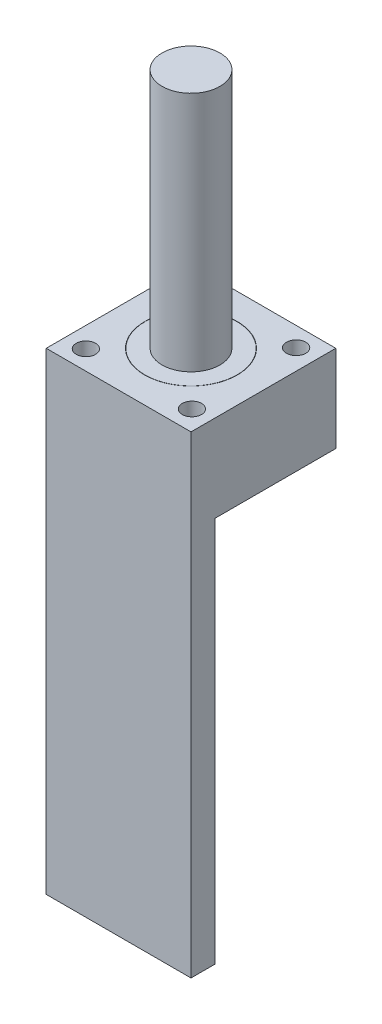
ISO-10303-21;
HEADER;
FILE_DESCRIPTION(('STEP AP214'),'2;1');
FILE_NAME('part.step','',(''),(''),'','','');
FILE_SCHEMA(('AUTOMOTIVE_DESIGN { 1 0 10303 214 1 1 1 1 }'));
ENDSEC;
DATA;
#1=APPLICATION_CONTEXT('core data for automotive mechanical design processes');
#2=APPLICATION_PROTOCOL_DEFINITION('international standard','automotive_design',2000,#1);
#3=PRODUCT_CONTEXT('',#1,'mechanical');
#4=PRODUCT('Part','Part','',(#3));
#5=PRODUCT_RELATED_PRODUCT_CATEGORY('part','',(#4));
#6=PRODUCT_DEFINITION_FORMATION('','',#4);
#7=PRODUCT_DEFINITION_CONTEXT('part definition',#1,'design');
#8=PRODUCT_DEFINITION('design','',#6,#7);
#9=PRODUCT_DEFINITION_SHAPE('','',#8);
#10=(LENGTH_UNIT() NAMED_UNIT(*) SI_UNIT(.MILLI.,.METRE.));
#11=(NAMED_UNIT(*) PLANE_ANGLE_UNIT() SI_UNIT($,.RADIAN.));
#12=(NAMED_UNIT(*) SI_UNIT($,.STERADIAN.) SOLID_ANGLE_UNIT());
#13=UNCERTAINTY_MEASURE_WITH_UNIT(LENGTH_MEASURE(1.E-05),#10,'distance_accuracy_value','');
#14=(GEOMETRIC_REPRESENTATION_CONTEXT(3) GLOBAL_UNCERTAINTY_ASSIGNED_CONTEXT((#13)) GLOBAL_UNIT_ASSIGNED_CONTEXT((#10,
#11,#12)) REPRESENTATION_CONTEXT('',''));
#15=CARTESIAN_POINT('',(0.,0.,0.));
#16=DIRECTION('',(0.,0.,1.));
#17=DIRECTION('',(1.,0.,0.));
#18=AXIS2_PLACEMENT_3D('',#15,#16,#17);
#19=CARTESIAN_POINT('',(0.,-18.,0.));
#20=DIRECTION('',(0.,1.,0.));
#21=DIRECTION('',(0.,0.,1.));
#22=AXIS2_PLACEMENT_3D('',#19,#20,#21);
#23=PLANE('',#22);
#24=DIRECTION('',(1.,0.,0.));
#25=VECTOR('',#24,1.);
#26=CARTESIAN_POINT('',(15.,-18.,10.));
#27=LINE('',#26,#25);
#28=CARTESIAN_POINT('',(-15.,-18.,10.));
#29=VERTEX_POINT('',#28);
#30=CARTESIAN_POINT('',(15.,-18.,10.));
#31=VERTEX_POINT('',#30);
#32=EDGE_CURVE('E65',#29,#31,#27,.T.);
#33=ORIENTED_EDGE('',*,*,#32,.F.);
#34=DIRECTION('',(0.,0.,-1.));
#35=VECTOR('',#34,1.);
#36=CARTESIAN_POINT('',(-15.,-18.,15.));
#37=LINE('',#36,#35);
#38=CARTESIAN_POINT('',(-15.,-18.,-15.));
#39=VERTEX_POINT('',#38);
#40=EDGE_CURVE('E146',#29,#39,#37,.T.);
#41=ORIENTED_EDGE('',*,*,#40,.T.);
#42=DIRECTION('',(1.,0.,0.));
#43=VECTOR('',#42,1.);
#44=CARTESIAN_POINT('',(15.,-18.,-15.));
#45=LINE('',#44,#43);
#46=CARTESIAN_POINT('',(15.,-18.,-15.));
#47=VERTEX_POINT('',#46);
#48=EDGE_CURVE('E149',#39,#47,#45,.T.);
#49=ORIENTED_EDGE('',*,*,#48,.T.);
#50=DIRECTION('',(0.,0.,1.));
#51=VECTOR('',#50,1.);
#52=CARTESIAN_POINT('',(15.,-18.,15.));
#53=LINE('',#52,#51);
#54=EDGE_CURVE('E143',#47,#31,#53,.T.);
#55=ORIENTED_EDGE('',*,*,#54,.T.);
#56=EDGE_LOOP('',(#33,#41,#49,#55));
#57=FACE_BOUND('',#56,.T.);
#58=ADVANCED_FACE('F49',(#57),#23,.F.);
#59=CARTESIAN_POINT('',(15.,0.,-15.));
#60=DIRECTION('',(-1.,0.,0.));
#61=DIRECTION('',(0.,0.,1.));
#62=AXIS2_PLACEMENT_3D('',#59,#60,#61);
#63=PLANE('',#62);
#64=DIRECTION('',(0.,-1.,0.));
#65=VECTOR('',#64,1.);
#66=CARTESIAN_POINT('',(15.,0.,15.));
#67=LINE('',#66,#65);
#68=CARTESIAN_POINT('',(15.,0.,15.));
#69=VERTEX_POINT('',#68);
#70=CARTESIAN_POINT('',(15.,-98.,15.));
#71=VERTEX_POINT('',#70);
#72=EDGE_CURVE('E103',#69,#71,#67,.T.);
#73=ORIENTED_EDGE('',*,*,#72,.T.);
#74=DIRECTION('',(0.,0.,1.));
#75=VECTOR('',#74,1.);
#76=CARTESIAN_POINT('',(15.,-98.,15.));
#77=LINE('',#76,#75);
#78=CARTESIAN_POINT('',(15.,-98.,10.));
#79=VERTEX_POINT('',#78);
#80=EDGE_CURVE('E107',#79,#71,#77,.T.);
#81=ORIENTED_EDGE('',*,*,#80,.F.);
#82=DIRECTION('',(0.,1.,0.));
#83=VECTOR('',#82,1.);
#84=CARTESIAN_POINT('',(15.,-98.,10.));
#85=LINE('',#84,#83);
#86=EDGE_CURVE('E135',#79,#31,#85,.T.);
#87=ORIENTED_EDGE('',*,*,#86,.T.);
#88=ORIENTED_EDGE('',*,*,#54,.F.);
#89=DIRECTION('',(0.,-1.,0.));
#90=VECTOR('',#89,1.);
#91=CARTESIAN_POINT('',(15.,0.,-15.));
#92=LINE('',#91,#90);
#93=CARTESIAN_POINT('',(15.,0.,-15.));
#94=VERTEX_POINT('',#93);
#95=EDGE_CURVE('E12',#94,#47,#92,.T.);
#96=ORIENTED_EDGE('',*,*,#95,.F.);
#97=DIRECTION('',(0.,0.,-1.));
#98=VECTOR('',#97,1.);
#99=CARTESIAN_POINT('',(15.,0.,-15.));
#100=LINE('',#99,#98);
#101=EDGE_CURVE('E109',#69,#94,#100,.T.);
#102=ORIENTED_EDGE('',*,*,#101,.F.);
#103=EDGE_LOOP('',(#73,#81,#87,#88,#96,#102));
#104=FACE_BOUND('',#103,.T.);
#105=ADVANCED_FACE('F51',(#104),#63,.F.);
#106=CARTESIAN_POINT('',(-15.,0.,-15.));
#107=DIRECTION('',(0.,0.,1.));
#108=DIRECTION('',(1.,0.,0.));
#109=AXIS2_PLACEMENT_3D('',#106,#107,#108);
#110=PLANE('',#109);
#111=ORIENTED_EDGE('',*,*,#95,.T.);
#112=ORIENTED_EDGE('',*,*,#48,.F.);
#113=DIRECTION('',(0.,-1.,0.));
#114=VECTOR('',#113,1.);
#115=CARTESIAN_POINT('',(-15.,0.,-15.));
#116=LINE('',#115,#114);
#117=CARTESIAN_POINT('',(-15.,0.,-15.));
#118=VERTEX_POINT('',#117);
#119=EDGE_CURVE('E58',#118,#39,#116,.T.);
#120=ORIENTED_EDGE('',*,*,#119,.F.);
#121=DIRECTION('',(-1.,0.,0.));
#122=VECTOR('',#121,1.);
#123=CARTESIAN_POINT('',(-15.,0.,-15.));
#124=LINE('',#123,#122);
#125=EDGE_CURVE('E211',#94,#118,#124,.T.);
#126=ORIENTED_EDGE('',*,*,#125,.F.);
#127=EDGE_LOOP('',(#111,#112,#120,#126));
#128=FACE_BOUND('',#127,.T.);
#129=ADVANCED_FACE('F229',(#128),#110,.F.);
#130=CARTESIAN_POINT('',(-15.,0.,-15.));
#131=DIRECTION('',(1.,0.,0.));
#132=DIRECTION('',(0.,0.,-1.));
#133=AXIS2_PLACEMENT_3D('',#130,#131,#132);
#134=PLANE('',#133);
#135=ORIENTED_EDGE('',*,*,#119,.T.);
#136=ORIENTED_EDGE('',*,*,#40,.F.);
#137=DIRECTION('',(0.,1.,0.));
#138=VECTOR('',#137,1.);
#139=CARTESIAN_POINT('',(-15.,-98.,9.99999999999999));
#140=LINE('',#139,#138);
#141=CARTESIAN_POINT('',(-15.,-98.,9.99999999999999));
#142=VERTEX_POINT('',#141);
#143=EDGE_CURVE('E139',#142,#29,#140,.T.);
#144=ORIENTED_EDGE('',*,*,#143,.F.);
#145=DIRECTION('',(0.,0.,-1.));
#146=VECTOR('',#145,1.);
#147=CARTESIAN_POINT('',(-15.,-98.,15.));
#148=LINE('',#147,#146);
#149=CARTESIAN_POINT('',(-15.,-98.,15.));
#150=VERTEX_POINT('',#149);
#151=EDGE_CURVE('E121',#150,#142,#148,.T.);
#152=ORIENTED_EDGE('',*,*,#151,.F.);
#153=DIRECTION('',(0.,-1.,0.));
#154=VECTOR('',#153,1.);
#155=CARTESIAN_POINT('',(-15.,0.,15.));
#156=LINE('',#155,#154);
#157=CARTESIAN_POINT('',(-15.,0.,15.));
#158=VERTEX_POINT('',#157);
#159=EDGE_CURVE('E112',#158,#150,#156,.T.);
#160=ORIENTED_EDGE('',*,*,#159,.F.);
#161=DIRECTION('',(0.,0.,1.));
#162=VECTOR('',#161,1.);
#163=CARTESIAN_POINT('',(-15.,0.,-15.));
#164=LINE('',#163,#162);
#165=EDGE_CURVE('E214',#118,#158,#164,.T.);
#166=ORIENTED_EDGE('',*,*,#165,.F.);
#167=EDGE_LOOP('',(#135,#136,#144,#152,#160,#166));
#168=FACE_BOUND('',#167,.T.);
#169=ADVANCED_FACE('F226',(#168),#134,.F.);
#170=CARTESIAN_POINT('',(-15.,0.,15.));
#171=DIRECTION('',(0.,0.,-1.));
#172=DIRECTION('',(-1.,0.,0.));
#173=AXIS2_PLACEMENT_3D('',#170,#171,#172);
#174=PLANE('',#173);
#175=ORIENTED_EDGE('',*,*,#159,.T.);
#176=DIRECTION('',(-1.,0.,0.));
#177=VECTOR('',#176,1.);
#178=CARTESIAN_POINT('',(15.,-98.,15.));
#179=LINE('',#178,#177);
#180=EDGE_CURVE('E115',#71,#150,#179,.T.);
#181=ORIENTED_EDGE('',*,*,#180,.F.);
#182=ORIENTED_EDGE('',*,*,#72,.F.);
#183=DIRECTION('',(1.,0.,0.));
#184=VECTOR('',#183,1.);
#185=CARTESIAN_POINT('',(-15.,0.,15.));
#186=LINE('',#185,#184);
#187=EDGE_CURVE('E73',#158,#69,#186,.T.);
#188=ORIENTED_EDGE('',*,*,#187,.F.);
#189=EDGE_LOOP('',(#175,#181,#182,#188));
#190=FACE_BOUND('',#189,.T.);
#191=ADVANCED_FACE('F116',(#190),#174,.F.);
#192=CARTESIAN_POINT('',(0.,0.,0.));
#193=DIRECTION('',(0.,1.,0.));
#194=DIRECTION('',(0.,0.,1.));
#195=AXIS2_PLACEMENT_3D('',#192,#193,#194);
#196=PLANE('',#195);
#197=CARTESIAN_POINT('',(-10.9875097580016,0.,-10.7923497267759));
#198=DIRECTION('',(0.,1.,0.));
#199=DIRECTION('',(1.,0.,0.));
#200=AXIS2_PLACEMENT_3D('',#197,#198,#199);
#201=CIRCLE('',#200,2.);
#202=CARTESIAN_POINT('',(-8.98750975800163,0.,-10.7923497267759));
#203=VERTEX_POINT('',#202);
#204=EDGE_CURVE('E158',#203,#203,#201,.T.);
#205=ORIENTED_EDGE('',*,*,#204,.F.);
#206=EDGE_LOOP('',(#205));
#207=FACE_BOUND('',#206,.T.);
#208=CARTESIAN_POINT('',(-10.792349726776,0.,10.9875097580016));
#209=DIRECTION('',(0.,1.,0.));
#210=DIRECTION('',(0.,0.,-1.));
#211=AXIS2_PLACEMENT_3D('',#208,#209,#210);
#212=CIRCLE('',#211,2.);
#213=CARTESIAN_POINT('',(-10.792349726776,0.,8.9875097580016));
#214=VERTEX_POINT('',#213);
#215=EDGE_CURVE('E159',#214,#214,#212,.T.);
#216=ORIENTED_EDGE('',*,*,#215,.F.);
#217=EDGE_LOOP('',(#216));
#218=FACE_BOUND('',#217,.T.);
#219=CARTESIAN_POINT('',(10.9875097580017,0.,10.7923497267758));
#220=DIRECTION('',(0.,1.,0.));
#221=DIRECTION('',(-1.,0.,0.));
#222=AXIS2_PLACEMENT_3D('',#219,#220,#221);
#223=CIRCLE('',#222,2.);
#224=CARTESIAN_POINT('',(8.98750975800172,0.,10.7923497267759));
#225=VERTEX_POINT('',#224);
#226=EDGE_CURVE('E168',#225,#225,#223,.T.);
#227=ORIENTED_EDGE('',*,*,#226,.F.);
#228=EDGE_LOOP('',(#227));
#229=FACE_BOUND('',#228,.T.);
#230=CARTESIAN_POINT('',(10.792349726776,0.,-10.9875097580016));
#231=DIRECTION('',(0.,1.,0.));
#232=DIRECTION('',(0.,0.,1.));
#233=AXIS2_PLACEMENT_3D('',#230,#231,#232);
#234=CIRCLE('',#233,2.);
#235=CARTESIAN_POINT('',(10.792349726776,0.,-8.9875097580016));
#236=VERTEX_POINT('',#235);
#237=EDGE_CURVE('E163',#236,#236,#234,.T.);
#238=ORIENTED_EDGE('',*,*,#237,.F.);
#239=EDGE_LOOP('',(#238));
#240=FACE_BOUND('',#239,.T.);
#241=CARTESIAN_POINT('',(0.,0.,0.));
#242=DIRECTION('',(0.,1.,0.));
#243=DIRECTION('',(0.,0.,1.));
#244=AXIS2_PLACEMENT_3D('',#241,#242,#243);
#245=CIRCLE('',#244,9.6);
#246=CARTESIAN_POINT('',(0.,0.,9.6));
#247=VERTEX_POINT('',#246);
#248=EDGE_CURVE('E198',#247,#247,#245,.T.);
#249=ORIENTED_EDGE('',*,*,#248,.F.);
#250=EDGE_LOOP('',(#249));
#251=FACE_BOUND('',#250,.T.);
#252=ORIENTED_EDGE('',*,*,#101,.T.);
#253=ORIENTED_EDGE('',*,*,#125,.T.);
#254=ORIENTED_EDGE('',*,*,#165,.T.);
#255=ORIENTED_EDGE('',*,*,#187,.T.);
#256=EDGE_LOOP('',(#252,#253,#254,#255));
#257=FACE_BOUND('',#256,.T.);
#258=ADVANCED_FACE('F287',(#207,#218,#229,#240,#251,#257),#196,.T.);
#259=CARTESIAN_POINT('',(0.,-7.,0.));
#260=DIRECTION('',(0.,1.,0.));
#261=DIRECTION('',(0.,0.,1.));
#262=AXIS2_PLACEMENT_3D('',#259,#260,#261);
#263=CYLINDRICAL_SURFACE('',#262,9.6);
#264=CARTESIAN_POINT('',(0.,-7.,0.));
#265=DIRECTION('',(0.,1.,0.));
#266=DIRECTION('',(0.,0.,1.));
#267=AXIS2_PLACEMENT_3D('',#264,#265,#266);
#268=CIRCLE('',#267,9.6);
#269=CARTESIAN_POINT('',(0.,-7.,9.6));
#270=VERTEX_POINT('',#269);
#271=EDGE_CURVE('E202',#270,#270,#268,.T.);
#272=ORIENTED_EDGE('',*,*,#271,.F.);
#273=EDGE_LOOP('',(#272));
#274=FACE_BOUND('',#273,.T.);
#275=ORIENTED_EDGE('',*,*,#248,.T.);
#276=EDGE_LOOP('',(#275));
#277=FACE_BOUND('',#276,.T.);
#278=ADVANCED_FACE('F283',(#274,#277),#263,.F.);
#279=CARTESIAN_POINT('',(0.,-7.,0.));
#280=DIRECTION('',(0.,1.,0.));
#281=DIRECTION('',(0.,0.,1.));
#282=AXIS2_PLACEMENT_3D('',#279,#280,#281);
#283=PLANE('',#282);
#284=CARTESIAN_POINT('',(0.,-7.,0.));
#285=DIRECTION('',(0.,1.,0.));
#286=DIRECTION('',(0.,0.,1.));
#287=AXIS2_PLACEMENT_3D('',#284,#285,#286);
#288=CIRCLE('',#287,9.55);
#289=CARTESIAN_POINT('',(0.,-7.,9.55));
#290=VERTEX_POINT('',#289);
#291=EDGE_CURVE('E194',#290,#290,#288,.T.);
#292=ORIENTED_EDGE('',*,*,#291,.F.);
#293=EDGE_LOOP('',(#292));
#294=FACE_BOUND('',#293,.T.);
#295=ORIENTED_EDGE('',*,*,#271,.T.);
#296=EDGE_LOOP('',(#295));
#297=FACE_BOUND('',#296,.T.);
#298=ADVANCED_FACE('F279',(#294,#297),#283,.T.);
#299=CARTESIAN_POINT('',(0.,-7.,0.));
#300=DIRECTION('',(0.,1.,0.));
#301=DIRECTION('',(0.,0.,1.));
#302=AXIS2_PLACEMENT_3D('',#299,#300,#301);
#303=CYLINDRICAL_SURFACE('',#302,9.55);
#304=ORIENTED_EDGE('',*,*,#291,.T.);
#305=EDGE_LOOP('',(#304));
#306=FACE_BOUND('',#305,.T.);
#307=CARTESIAN_POINT('',(0.,0.,0.));
#308=DIRECTION('',(0.,1.,0.));
#309=DIRECTION('',(0.,0.,1.));
#310=AXIS2_PLACEMENT_3D('',#307,#308,#309);
#311=CIRCLE('',#310,9.55);
#312=CARTESIAN_POINT('',(0.,0.,9.55));
#313=VERTEX_POINT('',#312);
#314=EDGE_CURVE('E190',#313,#313,#311,.T.);
#315=ORIENTED_EDGE('',*,*,#314,.F.);
#316=EDGE_LOOP('',(#315));
#317=FACE_BOUND('',#316,.T.);
#318=ADVANCED_FACE('F276',(#306,#317),#303,.T.);
#319=CARTESIAN_POINT('',(0.,0.,0.));
#320=DIRECTION('',(0.,1.,0.));
#321=DIRECTION('',(0.,0.,1.));
#322=AXIS2_PLACEMENT_3D('',#319,#320,#321);
#323=CIRCLE('',#322,4.);
#324=CARTESIAN_POINT('',(0.,0.,4.));
#325=VERTEX_POINT('',#324);
#326=EDGE_CURVE('E182',#325,#325,#323,.T.);
#327=ORIENTED_EDGE('',*,*,#326,.F.);
#328=EDGE_LOOP('',(#327));
#329=FACE_BOUND('',#328,.T.);
#330=ORIENTED_EDGE('',*,*,#314,.T.);
#331=EDGE_LOOP('',(#330));
#332=FACE_BOUND('',#331,.T.);
#333=ADVANCED_FACE('F274',(#329,#332),#196,.T.);
#334=CARTESIAN_POINT('',(0.,-7.,0.));
#335=DIRECTION('',(0.,1.,0.));
#336=DIRECTION('',(0.,0.,1.));
#337=AXIS2_PLACEMENT_3D('',#334,#335,#336);
#338=CYLINDRICAL_SURFACE('',#337,4.);
#339=CARTESIAN_POINT('',(0.,-7.,0.));
#340=DIRECTION('',(0.,1.,0.));
#341=DIRECTION('',(0.,0.,1.));
#342=AXIS2_PLACEMENT_3D('',#339,#340,#341);
#343=CIRCLE('',#342,4.);
#344=CARTESIAN_POINT('',(0.,-7.,4.));
#345=VERTEX_POINT('',#344);
#346=EDGE_CURVE('E186',#345,#345,#343,.T.);
#347=ORIENTED_EDGE('',*,*,#346,.F.);
#348=EDGE_LOOP('',(#347));
#349=FACE_BOUND('',#348,.T.);
#350=ORIENTED_EDGE('',*,*,#326,.T.);
#351=EDGE_LOOP('',(#350));
#352=FACE_BOUND('',#351,.T.);
#353=ADVANCED_FACE('F270',(#349,#352),#338,.F.);
#354=CARTESIAN_POINT('',(0.,-7.,0.));
#355=DIRECTION('',(0.,1.,0.));
#356=DIRECTION('',(0.,0.,1.));
#357=AXIS2_PLACEMENT_3D('',#354,#355,#356);
#358=PLANE('',#357);
#359=ORIENTED_EDGE('',*,*,#346,.T.);
#360=EDGE_LOOP('',(#359));
#361=FACE_BOUND('',#360,.T.);
#362=ADVANCED_FACE('F266',(#361),#358,.T.);
#363=CARTESIAN_POINT('',(10.792349726776,-10.,-10.9875097580016));
#364=DIRECTION('',(0.,1.,0.));
#365=DIRECTION('',(0.,0.,1.));
#366=AXIS2_PLACEMENT_3D('',#363,#364,#365);
#367=CYLINDRICAL_SURFACE('',#366,2.);
#368=CARTESIAN_POINT('',(10.792349726776,-10.,-10.9875097580016));
#369=DIRECTION('',(0.,1.,0.));
#370=DIRECTION('',(0.,0.,1.));
#371=AXIS2_PLACEMENT_3D('',#368,#369,#370);
#372=CIRCLE('',#371,2.);
#373=CARTESIAN_POINT('',(10.792349726776,-10.,-8.9875097580016));
#374=VERTEX_POINT('',#373);
#375=EDGE_CURVE('E178',#374,#374,#372,.T.);
#376=ORIENTED_EDGE('',*,*,#375,.F.);
#377=EDGE_LOOP('',(#376));
#378=FACE_BOUND('',#377,.T.);
#379=ORIENTED_EDGE('',*,*,#237,.T.);
#380=EDGE_LOOP('',(#379));
#381=FACE_BOUND('',#380,.T.);
#382=ADVANCED_FACE('F262',(#378,#381),#367,.F.);
#383=CARTESIAN_POINT('',(10.9875097580017,-10.,10.7923497267758));
#384=DIRECTION('',(0.,1.,0.));
#385=DIRECTION('',(-1.,0.,0.));
#386=AXIS2_PLACEMENT_3D('',#383,#384,#385);
#387=CYLINDRICAL_SURFACE('',#386,2.);
#388=CARTESIAN_POINT('',(10.9875097580017,-10.,10.7923497267758));
#389=DIRECTION('',(0.,1.,0.));
#390=DIRECTION('',(-1.,0.,0.));
#391=AXIS2_PLACEMENT_3D('',#388,#389,#390);
#392=CIRCLE('',#391,2.);
#393=CARTESIAN_POINT('',(8.98750975800172,-10.,10.7923497267759));
#394=VERTEX_POINT('',#393);
#395=EDGE_CURVE('E153',#394,#394,#392,.T.);
#396=ORIENTED_EDGE('',*,*,#395,.F.);
#397=EDGE_LOOP('',(#396));
#398=FACE_BOUND('',#397,.T.);
#399=ORIENTED_EDGE('',*,*,#226,.T.);
#400=EDGE_LOOP('',(#399));
#401=FACE_BOUND('',#400,.T.);
#402=ADVANCED_FACE('F258',(#398,#401),#387,.F.);
#403=CARTESIAN_POINT('',(-10.792349726776,-10.,10.9875097580016));
#404=DIRECTION('',(0.,1.,0.));
#405=DIRECTION('',(0.,0.,-1.));
#406=AXIS2_PLACEMENT_3D('',#403,#404,#405);
#407=CYLINDRICAL_SURFACE('',#406,2.);
#408=CARTESIAN_POINT('',(-10.792349726776,-10.,10.9875097580016));
#409=DIRECTION('',(0.,1.,0.));
#410=DIRECTION('',(0.,0.,-1.));
#411=AXIS2_PLACEMENT_3D('',#408,#409,#410);
#412=CIRCLE('',#411,2.);
#413=CARTESIAN_POINT('',(-10.792349726776,-10.,8.9875097580016));
#414=VERTEX_POINT('',#413);
#415=EDGE_CURVE('E164',#414,#414,#412,.T.);
#416=ORIENTED_EDGE('',*,*,#415,.F.);
#417=EDGE_LOOP('',(#416));
#418=FACE_BOUND('',#417,.T.);
#419=ORIENTED_EDGE('',*,*,#215,.T.);
#420=EDGE_LOOP('',(#419));
#421=FACE_BOUND('',#420,.T.);
#422=ADVANCED_FACE('F254',(#418,#421),#407,.F.);
#423=CARTESIAN_POINT('',(-10.9875097580016,-10.,-10.7923497267759));
#424=DIRECTION('',(0.,1.,0.));
#425=DIRECTION('',(1.,0.,0.));
#426=AXIS2_PLACEMENT_3D('',#423,#424,#425);
#427=CYLINDRICAL_SURFACE('',#426,2.);
#428=CARTESIAN_POINT('',(-10.9875097580016,-10.,-10.7923497267759));
#429=DIRECTION('',(0.,1.,0.));
#430=DIRECTION('',(1.,0.,0.));
#431=AXIS2_PLACEMENT_3D('',#428,#429,#430);
#432=CIRCLE('',#431,2.);
#433=CARTESIAN_POINT('',(-8.98750975800163,-10.,-10.7923497267759));
#434=VERTEX_POINT('',#433);
#435=EDGE_CURVE('E154',#434,#434,#432,.T.);
#436=ORIENTED_EDGE('',*,*,#435,.F.);
#437=EDGE_LOOP('',(#436));
#438=FACE_BOUND('',#437,.T.);
#439=ORIENTED_EDGE('',*,*,#204,.T.);
#440=EDGE_LOOP('',(#439));
#441=FACE_BOUND('',#440,.T.);
#442=ADVANCED_FACE('F251',(#438,#441),#427,.F.);
#443=CARTESIAN_POINT('',(0.,-10.,0.));
#444=DIRECTION('',(0.,1.,0.));
#445=DIRECTION('',(0.,0.,1.));
#446=AXIS2_PLACEMENT_3D('',#443,#444,#445);
#447=PLANE('',#446);
#448=ORIENTED_EDGE('',*,*,#375,.T.);
#449=EDGE_LOOP('',(#448));
#450=FACE_BOUND('',#449,.T.);
#451=ADVANCED_FACE('F244',(#450),#447,.T.);
#452=ORIENTED_EDGE('',*,*,#395,.T.);
#453=EDGE_LOOP('',(#452));
#454=FACE_BOUND('',#453,.T.);
#455=ADVANCED_FACE('F360',(#454),#447,.T.);
#456=ORIENTED_EDGE('',*,*,#415,.T.);
#457=EDGE_LOOP('',(#456));
#458=FACE_BOUND('',#457,.T.);
#459=ADVANCED_FACE('F241',(#458),#447,.T.);
#460=ORIENTED_EDGE('',*,*,#435,.T.);
#461=EDGE_LOOP('',(#460));
#462=FACE_BOUND('',#461,.T.);
#463=ADVANCED_FACE('F234',(#462),#447,.T.);
#464=CARTESIAN_POINT('',(15.,-98.,10.));
#465=DIRECTION('',(0.,0.,1.));
#466=DIRECTION('',(1.,0.,0.));
#467=AXIS2_PLACEMENT_3D('',#464,#465,#466);
#468=PLANE('',#467);
#469=ORIENTED_EDGE('',*,*,#32,.T.);
#470=ORIENTED_EDGE('',*,*,#86,.F.);
#471=DIRECTION('',(1.,0.,0.));
#472=VECTOR('',#471,1.);
#473=CARTESIAN_POINT('',(15.,-98.,10.));
#474=LINE('',#473,#472);
#475=EDGE_CURVE('E125',#142,#79,#474,.T.);
#476=ORIENTED_EDGE('',*,*,#475,.F.);
#477=ORIENTED_EDGE('',*,*,#143,.T.);
#478=EDGE_LOOP('',(#469,#470,#476,#477));
#479=FACE_BOUND('',#478,.T.);
#480=ADVANCED_FACE('F232',(#479),#468,.F.);
#481=CARTESIAN_POINT('',(0.,-98.,0.));
#482=DIRECTION('',(0.,1.,0.));
#483=DIRECTION('',(0.,0.,1.));
#484=AXIS2_PLACEMENT_3D('',#481,#482,#483);
#485=PLANE('',#484);
#486=ORIENTED_EDGE('',*,*,#80,.T.);
#487=ORIENTED_EDGE('',*,*,#180,.T.);
#488=ORIENTED_EDGE('',*,*,#151,.T.);
#489=ORIENTED_EDGE('',*,*,#475,.T.);
#490=EDGE_LOOP('',(#486,#487,#488,#489));
#491=FACE_BOUND('',#490,.T.);
#492=ADVANCED_FACE('F123',(#491),#485,.F.);
#493=CLOSED_SHELL('',(#58,#105,#129,#169,#191,#258,#278,#298,#318,#333,#353,#362,#382,#402,#422,
#442,#451,#455,#459,#463,#480,#492));
#494=MANIFOLD_SOLID_BREP('B2',#493);
#495=CARTESIAN_POINT('',(0.,50.,0.));
#496=DIRECTION('',(0.,-1.,0.));
#497=DIRECTION('',(0.,0.,-1.));
#498=AXIS2_PLACEMENT_3D('',#495,#496,#497);
#499=CYLINDRICAL_SURFACE('',#498,6.);
#500=CARTESIAN_POINT('',(0.,50.,0.));
#501=DIRECTION('',(0.,1.,0.));
#502=DIRECTION('',(0.,0.,1.));
#503=AXIS2_PLACEMENT_3D('',#500,#501,#502);
#504=CIRCLE('',#503,6.);
#505=CARTESIAN_POINT('',(0.,50.,6.));
#506=VERTEX_POINT('',#505);
#507=EDGE_CURVE('E48',#506,#506,#504,.T.);
#508=ORIENTED_EDGE('',*,*,#507,.F.);
#509=EDGE_LOOP('',(#508));
#510=FACE_BOUND('',#509,.T.);
#511=CARTESIAN_POINT('',(0.,0.,0.));
#512=DIRECTION('',(0.,1.,0.));
#513=DIRECTION('',(0.,0.,1.));
#514=AXIS2_PLACEMENT_3D('',#511,#512,#513);
#515=CIRCLE('',#514,6.);
#516=CARTESIAN_POINT('',(0.,0.,6.));
#517=VERTEX_POINT('',#516);
#518=EDGE_CURVE('E497',#517,#517,#515,.T.);
#519=ORIENTED_EDGE('',*,*,#518,.T.);
#520=EDGE_LOOP('',(#519));
#521=FACE_BOUND('',#520,.T.);
#522=ADVANCED_FACE('F494',(#510,#521),#499,.T.);
#523=CARTESIAN_POINT('',(0.,50.,0.));
#524=DIRECTION('',(0.,1.,0.));
#525=DIRECTION('',(0.,0.,1.));
#526=AXIS2_PLACEMENT_3D('',#523,#524,#525);
#527=PLANE('',#526);
#528=ORIENTED_EDGE('',*,*,#507,.T.);
#529=EDGE_LOOP('',(#528));
#530=FACE_BOUND('',#529,.T.);
#531=ADVANCED_FACE('F509',(#530),#527,.T.);
#532=CARTESIAN_POINT('',(0.,0.,0.));
#533=DIRECTION('',(0.,1.,0.));
#534=DIRECTION('',(0.,0.,1.));
#535=AXIS2_PLACEMENT_3D('',#532,#533,#534);
#536=PLANE('',#535);
#537=ORIENTED_EDGE('',*,*,#518,.F.);
#538=EDGE_LOOP('',(#537));
#539=FACE_BOUND('',#538,.T.);
#540=ADVANCED_FACE('F507',(#539),#536,.F.);
#541=CLOSED_SHELL('',(#522,#531,#540));
#542=MANIFOLD_SOLID_BREP('B6',#541);
#543=ADVANCED_BREP_SHAPE_REPRESENTATION('',(#18,#494,#542),#14);
#544=SHAPE_DEFINITION_REPRESENTATION(#9,#543);
ENDSEC;
END-ISO-10303-21;
